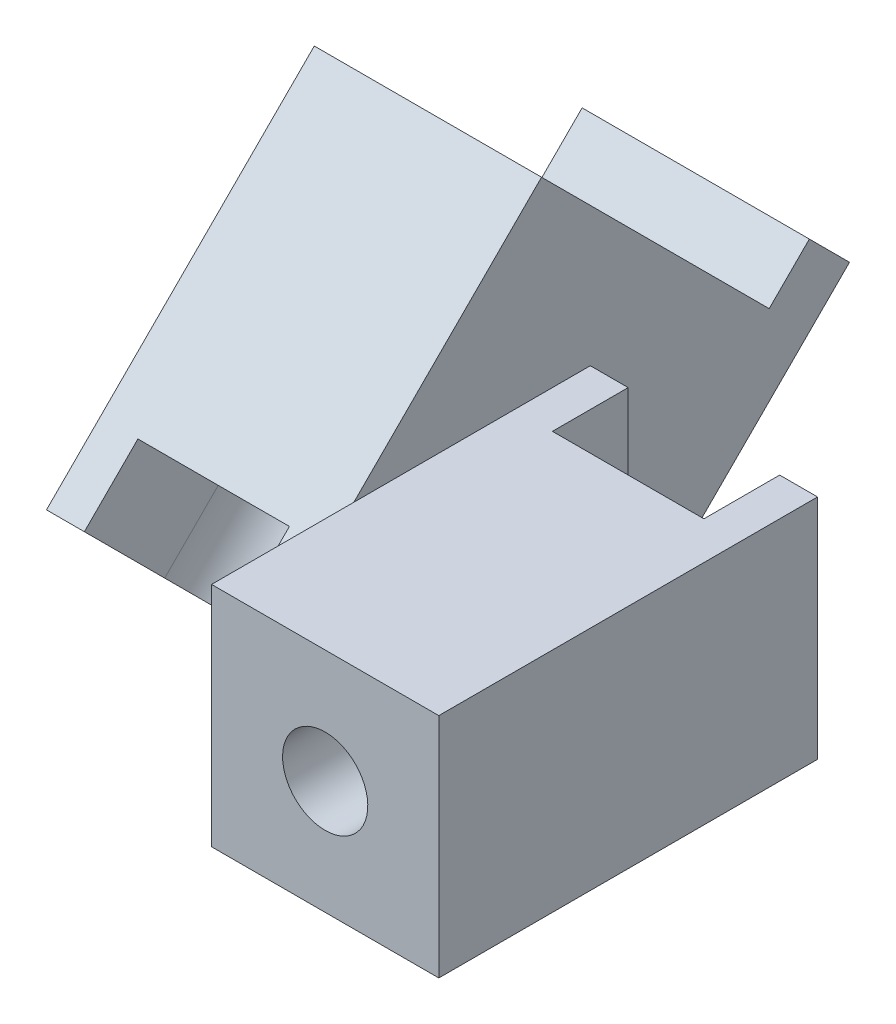
ISO-10303-21;
HEADER;
FILE_DESCRIPTION(('STEP AP214'),'2;1');
FILE_NAME('part.step','',(''),(''),'','','');
FILE_SCHEMA(('AUTOMOTIVE_DESIGN { 1 0 10303 214 1 1 1 1 }'));
ENDSEC;
DATA;
#1=APPLICATION_CONTEXT('core data for automotive mechanical design processes');
#2=APPLICATION_PROTOCOL_DEFINITION('international standard','automotive_design',2000,#1);
#3=PRODUCT_CONTEXT('',#1,'mechanical');
#4=PRODUCT('Part','Part','',(#3));
#5=PRODUCT_RELATED_PRODUCT_CATEGORY('part','',(#4));
#6=PRODUCT_DEFINITION_FORMATION('','',#4);
#7=PRODUCT_DEFINITION_CONTEXT('part definition',#1,'design');
#8=PRODUCT_DEFINITION('design','',#6,#7);
#9=PRODUCT_DEFINITION_SHAPE('','',#8);
#10=(LENGTH_UNIT() NAMED_UNIT(*) SI_UNIT(.MILLI.,.METRE.));
#11=(NAMED_UNIT(*) PLANE_ANGLE_UNIT() SI_UNIT($,.RADIAN.));
#12=(NAMED_UNIT(*) SI_UNIT($,.STERADIAN.) SOLID_ANGLE_UNIT());
#13=UNCERTAINTY_MEASURE_WITH_UNIT(LENGTH_MEASURE(1.E-05),#10,'distance_accuracy_value','');
#14=(GEOMETRIC_REPRESENTATION_CONTEXT(3) GLOBAL_UNCERTAINTY_ASSIGNED_CONTEXT((#13)) GLOBAL_UNIT_ASSIGNED_CONTEXT((#10,
#11,#12)) REPRESENTATION_CONTEXT('',''));
#15=CARTESIAN_POINT('',(0.,0.,0.));
#16=DIRECTION('',(0.,0.,1.));
#17=DIRECTION('',(1.,0.,0.));
#18=AXIS2_PLACEMENT_3D('',#15,#16,#17);
#19=CARTESIAN_POINT('',(0.,6.35355339059327,3.31801948466056));
#20=DIRECTION('',(0.,-0.707106781186549,0.707106781186546));
#21=DIRECTION('',(1.,0.,0.));
#22=AXIS2_PLACEMENT_3D('',#19,#20,#21);
#23=CYLINDRICAL_SURFACE('',#22,4.);
#24=DIRECTION('',(0.,-0.707106781186549,0.707106781186546));
#25=VECTOR('',#24,1.);
#26=CARTESIAN_POINT('',(-4.,13.4246212024588,-3.75304832720491));
#27=LINE('',#26,#25);
#28=CARTESIAN_POINT('',(-4.,6.35355339059327,3.31801948466056));
#29=VERTEX_POINT('',#28);
#30=CARTESIAN_POINT('',(-4.,3.52512626584708,6.14644660940674));
#31=VERTEX_POINT('',#30);
#32=EDGE_CURVE('E58',#29,#31,#27,.T.);
#33=ORIENTED_EDGE('',*,*,#32,.T.);
#34=CARTESIAN_POINT('',(0.,3.52512626584708,6.14644660940674));
#35=DIRECTION('',(0.,-0.707106781186549,0.707106781186546));
#36=DIRECTION('',(1.,0.,0.));
#37=AXIS2_PLACEMENT_3D('',#34,#35,#36);
#38=CIRCLE('',#37,4.);
#39=CARTESIAN_POINT('',(4.,3.52512626584708,6.14644660940674));
#40=VERTEX_POINT('',#39);
#41=EDGE_CURVE('E281',#31,#40,#38,.T.);
#42=ORIENTED_EDGE('',*,*,#41,.T.);
#43=DIRECTION('',(0.,-0.707106781186549,0.707106781186546));
#44=VECTOR('',#43,1.);
#45=CARTESIAN_POINT('',(4.,13.4246212024588,-3.75304832720491));
#46=LINE('',#45,#44);
#47=CARTESIAN_POINT('',(4.,6.35355339059327,3.31801948466056));
#48=VERTEX_POINT('',#47);
#49=EDGE_CURVE('E328',#48,#40,#46,.T.);
#50=ORIENTED_EDGE('',*,*,#49,.F.);
#51=CARTESIAN_POINT('',(0.,6.35355339059327,3.31801948466056));
#52=DIRECTION('',(0.,-0.707106781186549,0.707106781186546));
#53=DIRECTION('',(1.,0.,0.));
#54=AXIS2_PLACEMENT_3D('',#51,#52,#53);
#55=CIRCLE('',#54,4.);
#56=EDGE_CURVE('E336',#29,#48,#55,.T.);
#57=ORIENTED_EDGE('',*,*,#56,.F.);
#58=EDGE_LOOP('',(#33,#42,#50,#57));
#59=FACE_BOUND('',#58,.T.);
#60=ADVANCED_FACE('F33',(#59),#23,.F.);
#61=CARTESIAN_POINT('',(0.,3.52512626584708,6.14644660940674));
#62=DIRECTION('',(0.,0.707106781186549,-0.707106781186546));
#63=DIRECTION('',(-1.,0.,0.));
#64=AXIS2_PLACEMENT_3D('',#61,#62,#63);
#65=CYLINDRICAL_SURFACE('',#64,2.25);
#66=CARTESIAN_POINT('',(0.,17.6672618895781,-7.99568901432419));
#67=DIRECTION('',(0.,0.707106781186549,-0.707106781186546));
#68=DIRECTION('',(-1.,0.,0.));
#69=AXIS2_PLACEMENT_3D('',#66,#67,#68);
#70=CIRCLE('',#69,2.25);
#71=CARTESIAN_POINT('',(-2.25,17.6672618895781,-7.99568901432419));
#72=VERTEX_POINT('',#71);
#73=EDGE_CURVE('E224',#72,#72,#70,.T.);
#74=ORIENTED_EDGE('',*,*,#73,.T.);
#75=EDGE_LOOP('',(#74));
#76=FACE_BOUND('',#75,.T.);
#77=CARTESIAN_POINT('',(0.,6.35355339059327,3.31801948466056));
#78=DIRECTION('',(0.,-0.707106781186549,0.707106781186546));
#79=DIRECTION('',(1.,0.,0.));
#80=AXIS2_PLACEMENT_3D('',#77,#78,#79);
#81=CIRCLE('',#80,2.25);
#82=CARTESIAN_POINT('',(2.25,6.35355339059327,3.31801948466056));
#83=VERTEX_POINT('',#82);
#84=EDGE_CURVE('E37',#83,#83,#81,.F.);
#85=ORIENTED_EDGE('',*,*,#84,.F.);
#86=EDGE_LOOP('',(#85));
#87=FACE_BOUND('',#86,.T.);
#88=ADVANCED_FACE('F372',(#76,#87),#65,.F.);
#89=CARTESIAN_POINT('',(12.,6.,-20.0165042944955));
#90=DIRECTION('',(0.,0.,1.));
#91=DIRECTION('',(0.,-1.,0.));
#92=AXIS2_PLACEMENT_3D('',#89,#90,#91);
#93=CYLINDRICAL_SURFACE('',#92,2.25);
#94=CARTESIAN_POINT('',(12.,6.,13.6715728752538));
#95=DIRECTION('',(0.,0.,1.));
#96=DIRECTION('',(0.,-1.,0.));
#97=AXIS2_PLACEMENT_3D('',#94,#95,#96);
#98=CIRCLE('',#97,2.25);
#99=CARTESIAN_POINT('',(12.,3.75,13.6715728752538));
#100=VERTEX_POINT('',#99);
#101=EDGE_CURVE('E208',#100,#100,#98,.T.);
#102=ORIENTED_EDGE('',*,*,#101,.T.);
#103=EDGE_LOOP('',(#102));
#104=FACE_BOUND('',#103,.T.);
#105=CARTESIAN_POINT('',(12.,6.,-2.32842712474617));
#106=DIRECTION('',(0.,0.,-1.));
#107=DIRECTION('',(0.,1.,0.));
#108=AXIS2_PLACEMENT_3D('',#105,#106,#107);
#109=CIRCLE('',#108,2.25);
#110=CARTESIAN_POINT('',(12.,8.25,-2.32842712474617));
#111=VERTEX_POINT('',#110);
#112=EDGE_CURVE('E268',#111,#111,#109,.F.);
#113=ORIENTED_EDGE('',*,*,#112,.F.);
#114=EDGE_LOOP('',(#113));
#115=FACE_BOUND('',#114,.T.);
#116=ADVANCED_FACE('F377',(#104,#115),#93,.F.);
#117=CARTESIAN_POINT('',(6.,3.52512626584708,6.14644660940674));
#118=DIRECTION('',(-1.,0.,0.));
#119=DIRECTION('',(0.,-0.707106781186546,-0.707106781186549));
#120=AXIS2_PLACEMENT_3D('',#117,#118,#119);
#121=PLANE('',#120);
#122=DIRECTION('',(0.,1.,0.));
#123=VECTOR('',#122,1.);
#124=CARTESIAN_POINT('',(6.,12.,-6.32842712474617));
#125=LINE('',#124,#123);
#126=CARTESIAN_POINT('',(6.,0.,-6.32842712474617));
#127=VERTEX_POINT('',#126);
#128=CARTESIAN_POINT('',(6.,12.,-6.32842712474617));
#129=VERTEX_POINT('',#128);
#130=EDGE_CURVE('E195',#127,#129,#125,.T.);
#131=ORIENTED_EDGE('',*,*,#130,.F.);
#132=DIRECTION('',(0.,0.,1.));
#133=VECTOR('',#132,1.);
#134=CARTESIAN_POINT('',(6.,0.,2.62132034355965));
#135=LINE('',#134,#133);
#136=CARTESIAN_POINT('',(6.,0.,-10.1274169979695));
#137=VERTEX_POINT('',#136);
#138=EDGE_CURVE('E275',#137,#127,#135,.T.);
#139=ORIENTED_EDGE('',*,*,#138,.F.);
#140=DIRECTION('',(0.,-0.707106781186549,0.707106781186546));
#141=VECTOR('',#140,1.);
#142=CARTESIAN_POINT('',(6.,9.88908729652605,-20.0165042944955));
#143=LINE('',#142,#141);
#144=CARTESIAN_POINT('',(6.,9.88908729652605,-20.0165042944955));
#145=VERTEX_POINT('',#144);
#146=EDGE_CURVE('E240',#145,#137,#143,.T.);
#147=ORIENTED_EDGE('',*,*,#146,.F.);
#148=DIRECTION('',(0.,-0.707106781186547,-0.707106781186548));
#149=VECTOR('',#148,1.);
#150=CARTESIAN_POINT('',(6.,12.0104076400857,-17.8951839509359));
#151=LINE('',#150,#149);
#152=CARTESIAN_POINT('',(6.,12.0104076400857,-17.8951839509359));
#153=VERTEX_POINT('',#152);
#154=EDGE_CURVE('E237',#153,#145,#151,.T.);
#155=ORIENTED_EDGE('',*,*,#154,.F.);
#156=DIRECTION('',(0.,0.707106781186549,-0.707106781186546));
#157=VECTOR('',#156,1.);
#158=CARTESIAN_POINT('',(6.,9.88908729652605,-15.7738636073762));
#159=LINE('',#158,#157);
#160=CARTESIAN_POINT('',(6.,9.88908729652605,-15.7738636073762));
#161=VERTEX_POINT('',#160);
#162=EDGE_CURVE('E234',#161,#153,#159,.T.);
#163=ORIENTED_EDGE('',*,*,#162,.F.);
#164=DIRECTION('',(0.,-0.707106781186546,-0.707106781186549));
#165=VECTOR('',#164,1.);
#166=CARTESIAN_POINT('',(6.,21.9099025766973,-3.7530483272049));
#167=LINE('',#166,#165);
#168=CARTESIAN_POINT('',(6.,21.9099025766973,-3.7530483272049));
#169=VERTEX_POINT('',#168);
#170=EDGE_CURVE('E231',#169,#161,#167,.T.);
#171=ORIENTED_EDGE('',*,*,#170,.F.);
#172=DIRECTION('',(0.,0.707106781186549,-0.707106781186547));
#173=VECTOR('',#172,1.);
#174=CARTESIAN_POINT('',(6.,7.76776695296636,10.389087296526));
#175=LINE('',#174,#173);
#176=CARTESIAN_POINT('',(6.,12.,6.15685424949242));
#177=VERTEX_POINT('',#176);
#178=EDGE_CURVE('E227',#177,#169,#175,.T.);
#179=ORIENTED_EDGE('',*,*,#178,.F.);
#180=DIRECTION('',(0.,0.,1.));
#181=VECTOR('',#180,1.);
#182=CARTESIAN_POINT('',(6.,12.,-6.32842712474617));
#183=LINE('',#182,#181);
#184=EDGE_CURVE('E219',#129,#177,#183,.T.);
#185=ORIENTED_EDGE('',*,*,#184,.F.);
#186=EDGE_LOOP('',(#131,#139,#147,#155,#163,#171,#179,#185));
#187=FACE_BOUND('',#186,.T.);
#188=ADVANCED_FACE('F299',(#187),#121,.F.);
#189=CARTESIAN_POINT('',(-6.,7.76776695296636,10.389087296526));
#190=DIRECTION('',(0.,-0.707106781186547,-0.707106781186549));
#191=DIRECTION('',(0.,0.707106781186549,-0.707106781186547));
#192=AXIS2_PLACEMENT_3D('',#189,#190,#191);
#193=PLANE('',#192);
#194=DIRECTION('',(1.,0.,0.));
#195=VECTOR('',#194,1.);
#196=CARTESIAN_POINT('',(-6.,7.76776695296636,10.389087296526));
#197=LINE('',#196,#195);
#198=CARTESIAN_POINT('',(-6.,7.76776695296636,10.389087296526));
#199=VERTEX_POINT('',#198);
#200=CARTESIAN_POINT('',(-4.,7.76776695296636,10.389087296526));
#201=VERTEX_POINT('',#200);
#202=EDGE_CURVE('E261',#199,#201,#197,.T.);
#203=ORIENTED_EDGE('',*,*,#202,.T.);
#204=DIRECTION('',(0.,-0.707106781186549,0.707106781186546));
#205=VECTOR('',#204,1.);
#206=CARTESIAN_POINT('',(-4.,17.667261889578,0.489592359914386));
#207=LINE('',#206,#205);
#208=CARTESIAN_POINT('',(-4.,10.5961940777126,7.56066017177985));
#209=VERTEX_POINT('',#208);
#210=EDGE_CURVE('E330',#209,#201,#207,.T.);
#211=ORIENTED_EDGE('',*,*,#210,.F.);
#212=DIRECTION('',(1.,0.,0.));
#213=VECTOR('',#212,1.);
#214=CARTESIAN_POINT('',(-4.,10.5961940777126,7.56066017177985));
#215=LINE('',#214,#213);
#216=CARTESIAN_POINT('',(4.,10.5961940777126,7.56066017177985));
#217=VERTEX_POINT('',#216);
#218=EDGE_CURVE('E319',#209,#217,#215,.T.);
#219=ORIENTED_EDGE('',*,*,#218,.T.);
#220=DIRECTION('',(0.,-0.707106781186549,0.707106781186546));
#221=VECTOR('',#220,1.);
#222=CARTESIAN_POINT('',(4.,17.667261889578,0.489592359914386));
#223=LINE('',#222,#221);
#224=CARTESIAN_POINT('',(4.,7.76776695296636,10.389087296526));
#225=VERTEX_POINT('',#224);
#226=EDGE_CURVE('E332',#217,#225,#223,.T.);
#227=ORIENTED_EDGE('',*,*,#226,.T.);
#228=CARTESIAN_POINT('',(6.,7.76776695296636,10.389087296526));
#229=VERTEX_POINT('',#228);
#230=EDGE_CURVE('E260',#225,#229,#197,.T.);
#231=ORIENTED_EDGE('',*,*,#230,.T.);
#232=EDGE_CURVE('E228',#229,#177,#175,.T.);
#233=ORIENTED_EDGE('',*,*,#232,.T.);
#234=ORIENTED_EDGE('',*,*,#178,.T.);
#235=DIRECTION('',(1.,0.,0.));
#236=VECTOR('',#235,1.);
#237=CARTESIAN_POINT('',(-6.,21.9099025766973,-3.7530483272049));
#238=LINE('',#237,#236);
#239=CARTESIAN_POINT('',(-6.,21.9099025766973,-3.7530483272049));
#240=VERTEX_POINT('',#239);
#241=EDGE_CURVE('E11',#240,#169,#238,.T.);
#242=ORIENTED_EDGE('',*,*,#241,.F.);
#243=DIRECTION('',(0.,0.707106781186549,-0.707106781186547));
#244=VECTOR('',#243,1.);
#245=CARTESIAN_POINT('',(-6.,7.76776695296636,10.389087296526));
#246=LINE('',#245,#244);
#247=EDGE_CURVE('E246',#199,#240,#246,.T.);
#248=ORIENTED_EDGE('',*,*,#247,.F.);
#249=EDGE_LOOP('',(#203,#211,#219,#227,#231,#233,#234,#242,#248));
#250=FACE_BOUND('',#249,.T.);
#251=ADVANCED_FACE('F35',(#250),#193,.F.);
#252=CARTESIAN_POINT('',(-6.,21.9099025766973,-3.7530483272049));
#253=DIRECTION('',(0.,-0.707106781186549,0.707106781186546));
#254=DIRECTION('',(1.,0.,0.));
#255=AXIS2_PLACEMENT_3D('',#252,#253,#254);
#256=PLANE('',#255);
#257=ORIENTED_EDGE('',*,*,#73,.F.);
#258=EDGE_LOOP('',(#257));
#259=FACE_BOUND('',#258,.T.);
#260=ORIENTED_EDGE('',*,*,#241,.T.);
#261=ORIENTED_EDGE('',*,*,#170,.T.);
#262=DIRECTION('',(1.,0.,0.));
#263=VECTOR('',#262,1.);
#264=CARTESIAN_POINT('',(-6.,9.88908729652605,-15.7738636073762));
#265=LINE('',#264,#263);
#266=CARTESIAN_POINT('',(-6.,9.88908729652605,-15.7738636073762));
#267=VERTEX_POINT('',#266);
#268=EDGE_CURVE('E42',#267,#161,#265,.T.);
#269=ORIENTED_EDGE('',*,*,#268,.F.);
#270=DIRECTION('',(0.,-0.707106781186546,-0.707106781186549));
#271=VECTOR('',#270,1.);
#272=CARTESIAN_POINT('',(-6.,21.9099025766973,-3.7530483272049));
#273=LINE('',#272,#271);
#274=EDGE_CURVE('E249',#240,#267,#273,.T.);
#275=ORIENTED_EDGE('',*,*,#274,.F.);
#276=EDGE_LOOP('',(#260,#261,#269,#275));
#277=FACE_BOUND('',#276,.T.);
#278=ADVANCED_FACE('F426',(#259,#277),#256,.F.);
#279=CARTESIAN_POINT('',(-6.,9.88908729652605,-15.7738636073762));
#280=DIRECTION('',(0.,-0.707106781186546,-0.707106781186549));
#281=DIRECTION('',(1.,0.,0.));
#282=AXIS2_PLACEMENT_3D('',#279,#280,#281);
#283=PLANE('',#282);
#284=ORIENTED_EDGE('',*,*,#268,.T.);
#285=ORIENTED_EDGE('',*,*,#162,.T.);
#286=DIRECTION('',(1.,0.,0.));
#287=VECTOR('',#286,1.);
#288=CARTESIAN_POINT('',(-6.,12.0104076400857,-17.8951839509359));
#289=LINE('',#288,#287);
#290=CARTESIAN_POINT('',(-6.,12.0104076400857,-17.8951839509359));
#291=VERTEX_POINT('',#290);
#292=EDGE_CURVE('E266',#291,#153,#289,.T.);
#293=ORIENTED_EDGE('',*,*,#292,.F.);
#294=DIRECTION('',(0.,0.707106781186549,-0.707106781186546));
#295=VECTOR('',#294,1.);
#296=CARTESIAN_POINT('',(-6.,9.88908729652605,-15.7738636073762));
#297=LINE('',#296,#295);
#298=EDGE_CURVE('E251',#267,#291,#297,.T.);
#299=ORIENTED_EDGE('',*,*,#298,.F.);
#300=EDGE_LOOP('',(#284,#285,#293,#299));
#301=FACE_BOUND('',#300,.T.);
#302=ADVANCED_FACE('F423',(#301),#283,.F.);
#303=CARTESIAN_POINT('',(-6.,12.0104076400857,-17.8951839509359));
#304=DIRECTION('',(0.,-0.707106781186548,0.707106781186547));
#305=DIRECTION('',(0.,-0.707106781186547,-0.707106781186548));
#306=AXIS2_PLACEMENT_3D('',#303,#304,#305);
#307=PLANE('',#306);
#308=ORIENTED_EDGE('',*,*,#292,.T.);
#309=ORIENTED_EDGE('',*,*,#154,.T.);
#310=DIRECTION('',(1.,0.,0.));
#311=VECTOR('',#310,1.);
#312=CARTESIAN_POINT('',(-6.,9.88908729652605,-20.0165042944955));
#313=LINE('',#312,#311);
#314=CARTESIAN_POINT('',(-6.,9.88908729652605,-20.0165042944955));
#315=VERTEX_POINT('',#314);
#316=EDGE_CURVE('E264',#315,#145,#313,.T.);
#317=ORIENTED_EDGE('',*,*,#316,.F.);
#318=DIRECTION('',(0.,-0.707106781186547,-0.707106781186548));
#319=VECTOR('',#318,1.);
#320=CARTESIAN_POINT('',(-6.,12.0104076400857,-17.8951839509359));
#321=LINE('',#320,#319);
#322=EDGE_CURVE('E253',#291,#315,#321,.T.);
#323=ORIENTED_EDGE('',*,*,#322,.F.);
#324=EDGE_LOOP('',(#308,#309,#317,#323));
#325=FACE_BOUND('',#324,.T.);
#326=ADVANCED_FACE('F419',(#325),#307,.F.);
#327=CARTESIAN_POINT('',(-6.,9.88908729652605,-20.0165042944955));
#328=DIRECTION('',(0.,0.707106781186546,0.707106781186549));
#329=DIRECTION('',(-1.,0.,0.));
#330=AXIS2_PLACEMENT_3D('',#327,#328,#329);
#331=PLANE('',#330);
#332=ORIENTED_EDGE('',*,*,#146,.T.);
#333=DIRECTION('',(1.,0.,0.));
#334=VECTOR('',#333,1.);
#335=CARTESIAN_POINT('',(-6.001,0.,-10.1274169979695));
#336=LINE('',#335,#334);
#337=CARTESIAN_POINT('',(-6.,0.,-10.1274169979695));
#338=VERTEX_POINT('',#337);
#339=EDGE_CURVE('E285',#338,#137,#336,.T.);
#340=ORIENTED_EDGE('',*,*,#339,.F.);
#341=DIRECTION('',(0.,-0.707106781186549,0.707106781186546));
#342=VECTOR('',#341,1.);
#343=CARTESIAN_POINT('',(-6.,9.88908729652605,-20.0165042944955));
#344=LINE('',#343,#342);
#345=EDGE_CURVE('E255',#315,#338,#344,.T.);
#346=ORIENTED_EDGE('',*,*,#345,.F.);
#347=ORIENTED_EDGE('',*,*,#316,.T.);
#348=EDGE_LOOP('',(#332,#340,#346,#347));
#349=FACE_BOUND('',#348,.T.);
#350=ADVANCED_FACE('F416',(#349),#331,.F.);
#351=CARTESIAN_POINT('',(-6.,-6.37436867076457,-3.75304832720494));
#352=DIRECTION('',(0.,0.707106781186549,-0.707106781186546));
#353=DIRECTION('',(-1.,0.,0.));
#354=AXIS2_PLACEMENT_3D('',#351,#352,#353);
#355=PLANE('',#354);
#356=ORIENTED_EDGE('',*,*,#41,.F.);
#357=DIRECTION('',(0.,-0.707106781186546,-0.707106781186549));
#358=VECTOR('',#357,1.);
#359=CARTESIAN_POINT('',(-4.,3.52512626584708,6.14644660940674));
#360=LINE('',#359,#358);
#361=EDGE_CURVE('E326',#201,#31,#360,.T.);
#362=ORIENTED_EDGE('',*,*,#361,.F.);
#363=ORIENTED_EDGE('',*,*,#202,.F.);
#364=DIRECTION('',(0.,0.707106781186546,0.707106781186549));
#365=VECTOR('',#364,1.);
#366=CARTESIAN_POINT('',(-6.,-6.37436867076457,-3.75304832720494));
#367=LINE('',#366,#365);
#368=CARTESIAN_POINT('',(-6.,0.,2.62132034355965));
#369=VERTEX_POINT('',#368);
#370=EDGE_CURVE('E258',#369,#199,#367,.T.);
#371=ORIENTED_EDGE('',*,*,#370,.F.);
#372=DIRECTION('',(1.,0.,0.));
#373=VECTOR('',#372,1.);
#374=CARTESIAN_POINT('',(-6.001,0.,2.62132034355965));
#375=LINE('',#374,#373);
#376=CARTESIAN_POINT('',(6.,0.,2.62132034355965));
#377=VERTEX_POINT('',#376);
#378=EDGE_CURVE('E286',#369,#377,#375,.T.);
#379=ORIENTED_EDGE('',*,*,#378,.T.);
#380=DIRECTION('',(0.,0.707106781186546,0.707106781186549));
#381=VECTOR('',#380,1.);
#382=CARTESIAN_POINT('',(6.,-6.37436867076457,-3.75304832720494));
#383=LINE('',#382,#381);
#384=EDGE_CURVE('E243',#377,#229,#383,.T.);
#385=ORIENTED_EDGE('',*,*,#384,.T.);
#386=ORIENTED_EDGE('',*,*,#230,.F.);
#387=DIRECTION('',(0.,0.707106781186546,0.707106781186549));
#388=VECTOR('',#387,1.);
#389=CARTESIAN_POINT('',(4.,7.76776695296636,10.389087296526));
#390=LINE('',#389,#388);
#391=EDGE_CURVE('E317',#40,#225,#390,.T.);
#392=ORIENTED_EDGE('',*,*,#391,.F.);
#393=EDGE_LOOP('',(#356,#362,#363,#371,#379,#385,#386,#392));
#394=FACE_BOUND('',#393,.T.);
#395=ADVANCED_FACE('F349',(#394),#355,.F.);
#396=CARTESIAN_POINT('',(-6.,3.52512626584708,6.14644660940674));
#397=DIRECTION('',(-1.,0.,0.));
#398=DIRECTION('',(0.,-0.707106781186546,-0.707106781186549));
#399=AXIS2_PLACEMENT_3D('',#396,#397,#398);
#400=PLANE('',#399);
#401=DIRECTION('',(0.,0.,1.));
#402=VECTOR('',#401,1.);
#403=CARTESIAN_POINT('',(-6.,0.,2.62132034355965));
#404=LINE('',#403,#402);
#405=EDGE_CURVE('E270',#338,#369,#404,.T.);
#406=ORIENTED_EDGE('',*,*,#405,.T.);
#407=ORIENTED_EDGE('',*,*,#370,.T.);
#408=ORIENTED_EDGE('',*,*,#247,.T.);
#409=ORIENTED_EDGE('',*,*,#274,.T.);
#410=ORIENTED_EDGE('',*,*,#298,.T.);
#411=ORIENTED_EDGE('',*,*,#322,.T.);
#412=ORIENTED_EDGE('',*,*,#345,.T.);
#413=EDGE_LOOP('',(#406,#407,#408,#409,#410,#411,#412));
#414=FACE_BOUND('',#413,.T.);
#415=ADVANCED_FACE('F407',(#414),#400,.T.);
#416=CARTESIAN_POINT('',(18.,0.,-6.32842712474617));
#417=DIRECTION('',(0.,1.,0.));
#418=DIRECTION('',(0.,0.,1.));
#419=AXIS2_PLACEMENT_3D('',#416,#417,#418);
#420=PLANE('',#419);
#421=DIRECTION('',(-1.,0.,0.));
#422=VECTOR('',#421,1.);
#423=CARTESIAN_POINT('',(18.,0.,13.6715728752538));
#424=LINE('',#423,#422);
#425=CARTESIAN_POINT('',(18.,0.,13.6715728752538));
#426=VERTEX_POINT('',#425);
#427=CARTESIAN_POINT('',(6.,0.,13.6715728752538));
#428=VERTEX_POINT('',#427);
#429=EDGE_CURVE('E204',#426,#428,#424,.T.);
#430=ORIENTED_EDGE('',*,*,#429,.T.);
#431=DIRECTION('',(0.,0.,1.));
#432=VECTOR('',#431,1.);
#433=CARTESIAN_POINT('',(6.,0.,-6.32842712474617));
#434=LINE('',#433,#432);
#435=EDGE_CURVE('E222',#377,#428,#434,.T.);
#436=ORIENTED_EDGE('',*,*,#435,.F.);
#437=ORIENTED_EDGE('',*,*,#378,.F.);
#438=ORIENTED_EDGE('',*,*,#405,.F.);
#439=ORIENTED_EDGE('',*,*,#339,.T.);
#440=ORIENTED_EDGE('',*,*,#138,.T.);
#441=DIRECTION('',(-1.,0.,0.));
#442=VECTOR('',#441,1.);
#443=CARTESIAN_POINT('',(18.,0.,-6.32842712474617));
#444=LINE('',#443,#442);
#445=CARTESIAN_POINT('',(18.,0.,-6.32842712474617));
#446=VERTEX_POINT('',#445);
#447=EDGE_CURVE('E198',#446,#127,#444,.T.);
#448=ORIENTED_EDGE('',*,*,#447,.F.);
#449=DIRECTION('',(0.,0.,1.));
#450=VECTOR('',#449,1.);
#451=CARTESIAN_POINT('',(18.,0.,-6.32842712474617));
#452=LINE('',#451,#450);
#453=EDGE_CURVE('E203',#446,#426,#452,.T.);
#454=ORIENTED_EDGE('',*,*,#453,.T.);
#455=EDGE_LOOP('',(#430,#436,#437,#438,#439,#440,#448,#454));
#456=FACE_BOUND('',#455,.T.);
#457=ADVANCED_FACE('F404',(#456),#420,.F.);
#458=CARTESIAN_POINT('',(6.,12.,-6.32842712474617));
#459=DIRECTION('',(1.,0.,0.));
#460=DIRECTION('',(0.,0.707106781186549,-0.707106781186546));
#461=AXIS2_PLACEMENT_3D('',#458,#459,#460);
#462=PLANE('',#461);
#463=ORIENTED_EDGE('',*,*,#232,.F.);
#464=ORIENTED_EDGE('',*,*,#384,.F.);
#465=ORIENTED_EDGE('',*,*,#435,.T.);
#466=DIRECTION('',(0.,1.,0.));
#467=VECTOR('',#466,1.);
#468=CARTESIAN_POINT('',(6.,12.,13.6715728752538));
#469=LINE('',#468,#467);
#470=CARTESIAN_POINT('',(6.,12.,13.6715728752538));
#471=VERTEX_POINT('',#470);
#472=EDGE_CURVE('E207',#428,#471,#469,.T.);
#473=ORIENTED_EDGE('',*,*,#472,.T.);
#474=EDGE_CURVE('E218',#177,#471,#183,.T.);
#475=ORIENTED_EDGE('',*,*,#474,.F.);
#476=EDGE_LOOP('',(#463,#464,#465,#473,#475));
#477=FACE_BOUND('',#476,.T.);
#478=ADVANCED_FACE('F401',(#477),#462,.F.);
#479=CARTESIAN_POINT('',(18.,12.,-6.32842712474617));
#480=DIRECTION('',(0.,-1.,0.));
#481=DIRECTION('',(0.,0.,-1.));
#482=AXIS2_PLACEMENT_3D('',#479,#480,#481);
#483=PLANE('',#482);
#484=DIRECTION('',(-1.,0.,0.));
#485=VECTOR('',#484,1.);
#486=CARTESIAN_POINT('',(16.,12.,-2.32842712474617));
#487=LINE('',#486,#485);
#488=CARTESIAN_POINT('',(16.,12.,-2.32842712474617));
#489=VERTEX_POINT('',#488);
#490=CARTESIAN_POINT('',(8.00000000000001,12.,-2.32842712474617));
#491=VERTEX_POINT('',#490);
#492=EDGE_CURVE('E318',#489,#491,#487,.T.);
#493=ORIENTED_EDGE('',*,*,#492,.T.);
#494=DIRECTION('',(0.,0.,-1.));
#495=VECTOR('',#494,1.);
#496=CARTESIAN_POINT('',(8.00000000000001,12.,7.67157287525383));
#497=LINE('',#496,#495);
#498=CARTESIAN_POINT('',(8.00000000000001,12.,-6.32842712474617));
#499=VERTEX_POINT('',#498);
#500=EDGE_CURVE('E305',#491,#499,#497,.T.);
#501=ORIENTED_EDGE('',*,*,#500,.T.);
#502=DIRECTION('',(1.,0.,0.));
#503=VECTOR('',#502,1.);
#504=CARTESIAN_POINT('',(18.,12.,-6.32842712474617));
#505=LINE('',#504,#503);
#506=EDGE_CURVE('E194',#129,#499,#505,.T.);
#507=ORIENTED_EDGE('',*,*,#506,.F.);
#508=ORIENTED_EDGE('',*,*,#184,.T.);
#509=ORIENTED_EDGE('',*,*,#474,.T.);
#510=DIRECTION('',(1.,0.,0.));
#511=VECTOR('',#510,1.);
#512=CARTESIAN_POINT('',(18.,12.,13.6715728752538));
#513=LINE('',#512,#511);
#514=CARTESIAN_POINT('',(18.,12.,13.6715728752538));
#515=VERTEX_POINT('',#514);
#516=EDGE_CURVE('E211',#471,#515,#513,.T.);
#517=ORIENTED_EDGE('',*,*,#516,.T.);
#518=DIRECTION('',(0.,0.,1.));
#519=VECTOR('',#518,1.);
#520=CARTESIAN_POINT('',(18.,12.,-6.32842712474617));
#521=LINE('',#520,#519);
#522=CARTESIAN_POINT('',(18.,12.,-6.32842712474617));
#523=VERTEX_POINT('',#522);
#524=EDGE_CURVE('E192',#523,#515,#521,.T.);
#525=ORIENTED_EDGE('',*,*,#524,.F.);
#526=CARTESIAN_POINT('',(16.,12.,-6.32842712474617));
#527=VERTEX_POINT('',#526);
#528=EDGE_CURVE('E184',#527,#523,#505,.T.);
#529=ORIENTED_EDGE('',*,*,#528,.F.);
#530=DIRECTION('',(0.,0.,-1.));
#531=VECTOR('',#530,1.);
#532=CARTESIAN_POINT('',(16.,12.,7.67157287525383));
#533=LINE('',#532,#531);
#534=EDGE_CURVE('E169',#489,#527,#533,.T.);
#535=ORIENTED_EDGE('',*,*,#534,.F.);
#536=EDGE_LOOP('',(#493,#501,#507,#508,#509,#517,#525,#529,#535));
#537=FACE_BOUND('',#536,.T.);
#538=ADVANCED_FACE('F190',(#537),#483,.F.);
#539=CARTESIAN_POINT('',(18.,0.,-6.32842712474617));
#540=DIRECTION('',(-1.,0.,0.));
#541=DIRECTION('',(0.,-0.707106781186549,0.707106781186546));
#542=AXIS2_PLACEMENT_3D('',#539,#540,#541);
#543=PLANE('',#542);
#544=DIRECTION('',(0.,-1.,0.));
#545=VECTOR('',#544,1.);
#546=CARTESIAN_POINT('',(18.,0.,13.6715728752538));
#547=LINE('',#546,#545);
#548=EDGE_CURVE('E213',#515,#426,#547,.T.);
#549=ORIENTED_EDGE('',*,*,#548,.T.);
#550=ORIENTED_EDGE('',*,*,#453,.F.);
#551=DIRECTION('',(0.,-1.,0.));
#552=VECTOR('',#551,1.);
#553=CARTESIAN_POINT('',(18.,0.,-6.32842712474617));
#554=LINE('',#553,#552);
#555=EDGE_CURVE('E197',#523,#446,#554,.T.);
#556=ORIENTED_EDGE('',*,*,#555,.F.);
#557=ORIENTED_EDGE('',*,*,#524,.T.);
#558=EDGE_LOOP('',(#549,#550,#556,#557));
#559=FACE_BOUND('',#558,.T.);
#560=ADVANCED_FACE('F392',(#559),#543,.F.);
#561=CARTESIAN_POINT('',(0.,3.52512626584708,-6.32842712474617));
#562=DIRECTION('',(0.,0.,1.));
#563=DIRECTION('',(0.,-1.,0.));
#564=AXIS2_PLACEMENT_3D('',#561,#562,#563);
#565=PLANE('',#564);
#566=ORIENTED_EDGE('',*,*,#506,.T.);
#567=DIRECTION('',(0.,1.,0.));
#568=VECTOR('',#567,1.);
#569=CARTESIAN_POINT('',(8.00000000000001,6.,-6.32842712474617));
#570=LINE('',#569,#568);
#571=CARTESIAN_POINT('',(8.00000000000001,6.,-6.32842712474617));
#572=VERTEX_POINT('',#571);
#573=EDGE_CURVE('E178',#572,#499,#570,.T.);
#574=ORIENTED_EDGE('',*,*,#573,.F.);
#575=CARTESIAN_POINT('',(12.,6.,-6.32842712474617));
#576=DIRECTION('',(0.,0.,-1.));
#577=DIRECTION('',(0.,1.,0.));
#578=AXIS2_PLACEMENT_3D('',#575,#576,#577);
#579=CIRCLE('',#578,4.);
#580=CARTESIAN_POINT('',(16.,6.,-6.32842712474617));
#581=VERTEX_POINT('',#580);
#582=EDGE_CURVE('E188',#581,#572,#579,.T.);
#583=ORIENTED_EDGE('',*,*,#582,.F.);
#584=DIRECTION('',(0.,-1.,0.));
#585=VECTOR('',#584,1.);
#586=CARTESIAN_POINT('',(16.,12.,-6.32842712474617));
#587=LINE('',#586,#585);
#588=EDGE_CURVE('E172',#527,#581,#587,.T.);
#589=ORIENTED_EDGE('',*,*,#588,.F.);
#590=ORIENTED_EDGE('',*,*,#528,.T.);
#591=ORIENTED_EDGE('',*,*,#555,.T.);
#592=ORIENTED_EDGE('',*,*,#447,.T.);
#593=ORIENTED_EDGE('',*,*,#130,.T.);
#594=EDGE_LOOP('',(#566,#574,#583,#589,#590,#591,#592,#593));
#595=FACE_BOUND('',#594,.T.);
#596=ADVANCED_FACE('F183',(#595),#565,.F.);
#597=CARTESIAN_POINT('',(0.,3.52512626584708,13.6715728752538));
#598=DIRECTION('',(0.,0.,1.));
#599=DIRECTION('',(0.,-1.,0.));
#600=AXIS2_PLACEMENT_3D('',#597,#598,#599);
#601=PLANE('',#600);
#602=ORIENTED_EDGE('',*,*,#101,.F.);
#603=EDGE_LOOP('',(#602));
#604=FACE_BOUND('',#603,.T.);
#605=ORIENTED_EDGE('',*,*,#429,.F.);
#606=ORIENTED_EDGE('',*,*,#548,.F.);
#607=ORIENTED_EDGE('',*,*,#516,.F.);
#608=ORIENTED_EDGE('',*,*,#472,.F.);
#609=EDGE_LOOP('',(#605,#606,#607,#608));
#610=FACE_BOUND('',#609,.T.);
#611=ADVANCED_FACE('F384',(#604,#610),#601,.T.);
#612=CARTESIAN_POINT('',(12.,6.,-2.32842712474617));
#613=DIRECTION('',(0.,0.,-1.));
#614=DIRECTION('',(0.,1.,0.));
#615=AXIS2_PLACEMENT_3D('',#612,#613,#614);
#616=PLANE('',#615);
#617=CARTESIAN_POINT('',(12.,6.,-2.32842712474617));
#618=DIRECTION('',(0.,0.,-1.));
#619=DIRECTION('',(0.,1.,0.));
#620=AXIS2_PLACEMENT_3D('',#617,#618,#619);
#621=CIRCLE('',#620,4.);
#622=CARTESIAN_POINT('',(16.,6.,-2.32842712474617));
#623=VERTEX_POINT('',#622);
#624=CARTESIAN_POINT('',(8.00000000000001,6.,-2.32842712474617));
#625=VERTEX_POINT('',#624);
#626=EDGE_CURVE('E271',#623,#625,#621,.T.);
#627=ORIENTED_EDGE('',*,*,#626,.T.);
#628=DIRECTION('',(0.,-1.,0.));
#629=VECTOR('',#628,1.);
#630=CARTESIAN_POINT('',(8.00000000000001,6.,-2.32842712474617));
#631=LINE('',#630,#629);
#632=EDGE_CURVE('E522',#491,#625,#631,.T.);
#633=ORIENTED_EDGE('',*,*,#632,.F.);
#634=ORIENTED_EDGE('',*,*,#492,.F.);
#635=DIRECTION('',(0.,1.,0.));
#636=VECTOR('',#635,1.);
#637=CARTESIAN_POINT('',(16.,12.,-2.32842712474617));
#638=LINE('',#637,#636);
#639=EDGE_CURVE('E50',#623,#489,#638,.T.);
#640=ORIENTED_EDGE('',*,*,#639,.F.);
#641=EDGE_LOOP('',(#627,#633,#634,#640));
#642=FACE_BOUND('',#641,.T.);
#643=ORIENTED_EDGE('',*,*,#112,.T.);
#644=EDGE_LOOP('',(#643));
#645=FACE_BOUND('',#644,.T.);
#646=ADVANCED_FACE('F381',(#642,#645),#616,.T.);
#647=CARTESIAN_POINT('',(12.,6.,-2.32842712474617));
#648=DIRECTION('',(0.,0.,-1.));
#649=DIRECTION('',(0.,1.,0.));
#650=AXIS2_PLACEMENT_3D('',#647,#648,#649);
#651=CYLINDRICAL_SURFACE('',#650,4.);
#652=ORIENTED_EDGE('',*,*,#582,.T.);
#653=DIRECTION('',(0.,0.,-1.));
#654=VECTOR('',#653,1.);
#655=CARTESIAN_POINT('',(8.00000000000001,6.,7.67157287525383));
#656=LINE('',#655,#654);
#657=EDGE_CURVE('E311',#625,#572,#656,.T.);
#658=ORIENTED_EDGE('',*,*,#657,.F.);
#659=ORIENTED_EDGE('',*,*,#626,.F.);
#660=DIRECTION('',(0.,0.,-1.));
#661=VECTOR('',#660,1.);
#662=CARTESIAN_POINT('',(16.,6.,7.67157287525383));
#663=LINE('',#662,#661);
#664=EDGE_CURVE('E177',#623,#581,#663,.T.);
#665=ORIENTED_EDGE('',*,*,#664,.T.);
#666=EDGE_LOOP('',(#652,#658,#659,#665));
#667=FACE_BOUND('',#666,.T.);
#668=ADVANCED_FACE('F310',(#667),#651,.F.);
#669=CARTESIAN_POINT('',(0.,6.35355339059327,3.31801948466056));
#670=DIRECTION('',(0.,-0.707106781186549,0.707106781186546));
#671=DIRECTION('',(1.,0.,0.));
#672=AXIS2_PLACEMENT_3D('',#669,#670,#671);
#673=PLANE('',#672);
#674=ORIENTED_EDGE('',*,*,#56,.T.);
#675=DIRECTION('',(0.,-0.707106781186546,-0.707106781186549));
#676=VECTOR('',#675,1.);
#677=CARTESIAN_POINT('',(4.,10.5961940777126,7.56066017177985));
#678=LINE('',#677,#676);
#679=EDGE_CURVE('E324',#217,#48,#678,.T.);
#680=ORIENTED_EDGE('',*,*,#679,.F.);
#681=ORIENTED_EDGE('',*,*,#218,.F.);
#682=DIRECTION('',(0.,0.707106781186546,0.707106781186549));
#683=VECTOR('',#682,1.);
#684=CARTESIAN_POINT('',(-4.,6.35355339059327,3.31801948466056));
#685=LINE('',#684,#683);
#686=EDGE_CURVE('E322',#29,#209,#685,.T.);
#687=ORIENTED_EDGE('',*,*,#686,.F.);
#688=EDGE_LOOP('',(#674,#680,#681,#687));
#689=FACE_BOUND('',#688,.T.);
#690=ORIENTED_EDGE('',*,*,#84,.T.);
#691=EDGE_LOOP('',(#690));
#692=FACE_BOUND('',#691,.T.);
#693=ADVANCED_FACE('F358',(#689,#692),#673,.T.);
#694=CARTESIAN_POINT('',(-4.,13.4246212024588,-3.75304832720491));
#695=DIRECTION('',(-1.,0.,0.));
#696=DIRECTION('',(0.,-0.707106781186546,-0.707106781186549));
#697=AXIS2_PLACEMENT_3D('',#694,#695,#696);
#698=PLANE('',#697);
#699=ORIENTED_EDGE('',*,*,#686,.T.);
#700=ORIENTED_EDGE('',*,*,#210,.T.);
#701=ORIENTED_EDGE('',*,*,#361,.T.);
#702=ORIENTED_EDGE('',*,*,#32,.F.);
#703=EDGE_LOOP('',(#699,#700,#701,#702));
#704=FACE_BOUND('',#703,.T.);
#705=ADVANCED_FACE('F360',(#704),#698,.F.);
#706=CARTESIAN_POINT('',(4.,17.667261889578,0.489592359914386));
#707=DIRECTION('',(1.,0.,0.));
#708=DIRECTION('',(0.,0.707106781186546,0.707106781186549));
#709=AXIS2_PLACEMENT_3D('',#706,#707,#708);
#710=PLANE('',#709);
#711=ORIENTED_EDGE('',*,*,#679,.T.);
#712=ORIENTED_EDGE('',*,*,#49,.T.);
#713=ORIENTED_EDGE('',*,*,#391,.T.);
#714=ORIENTED_EDGE('',*,*,#226,.F.);
#715=EDGE_LOOP('',(#711,#712,#713,#714));
#716=FACE_BOUND('',#715,.T.);
#717=ADVANCED_FACE('F353',(#716),#710,.F.);
#718=CARTESIAN_POINT('',(8.00000000000001,6.,7.67157287525383));
#719=DIRECTION('',(-1.,0.,0.));
#720=DIRECTION('',(0.,-0.707106781186549,0.707106781186546));
#721=AXIS2_PLACEMENT_3D('',#718,#719,#720);
#722=PLANE('',#721);
#723=ORIENTED_EDGE('',*,*,#632,.T.);
#724=ORIENTED_EDGE('',*,*,#657,.T.);
#725=ORIENTED_EDGE('',*,*,#573,.T.);
#726=ORIENTED_EDGE('',*,*,#500,.F.);
#727=EDGE_LOOP('',(#723,#724,#725,#726));
#728=FACE_BOUND('',#727,.T.);
#729=ADVANCED_FACE('F367',(#728),#722,.F.);
#730=CARTESIAN_POINT('',(16.,12.,7.67157287525383));
#731=DIRECTION('',(1.,0.,0.));
#732=DIRECTION('',(0.,0.707106781186549,-0.707106781186546));
#733=AXIS2_PLACEMENT_3D('',#730,#731,#732);
#734=PLANE('',#733);
#735=ORIENTED_EDGE('',*,*,#639,.T.);
#736=ORIENTED_EDGE('',*,*,#534,.T.);
#737=ORIENTED_EDGE('',*,*,#588,.T.);
#738=ORIENTED_EDGE('',*,*,#664,.F.);
#739=EDGE_LOOP('',(#735,#736,#737,#738));
#740=FACE_BOUND('',#739,.T.);
#741=ADVANCED_FACE('F171',(#740),#734,.F.);
#742=CLOSED_SHELL('',(#60,#88,#116,#188,#251,#278,#302,#326,#350,#395,#415,#457,#478,#538,#560,
#596,#611,#646,#668,#693,#705,#717,#729,#741));
#743=MANIFOLD_SOLID_BREP('B2',#742);
#744=ADVANCED_BREP_SHAPE_REPRESENTATION('',(#18,#743),#14);
#745=SHAPE_DEFINITION_REPRESENTATION(#9,#744);
ENDSEC;
END-ISO-10303-21;
